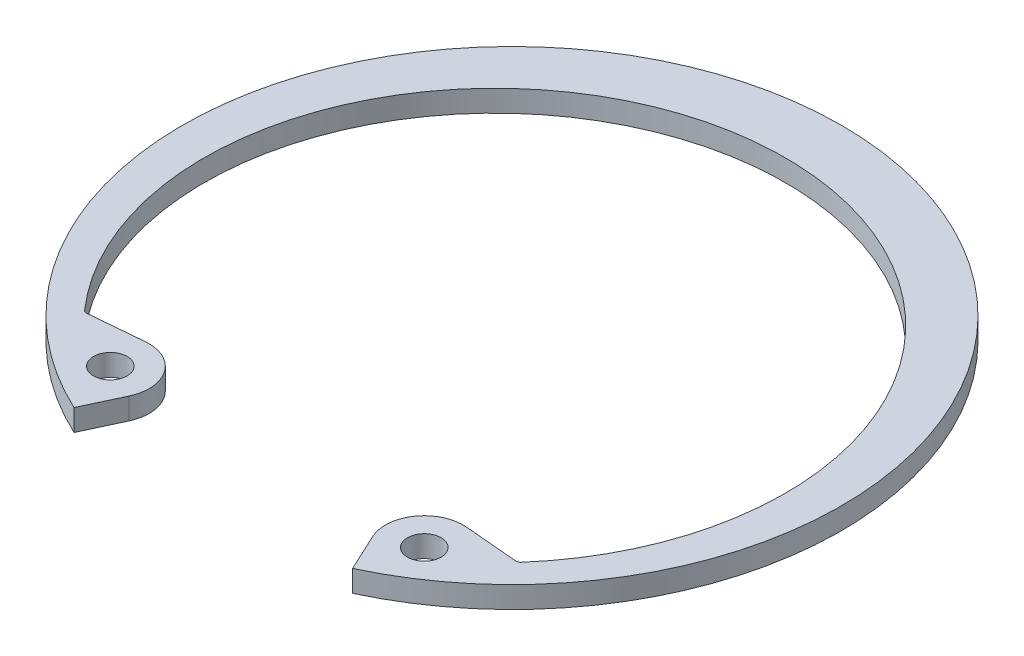
ISO-10303-21;
HEADER;
FILE_DESCRIPTION(('STEP AP214'),'2;1');
FILE_NAME('part.step','',(''),(''),'','','');
FILE_SCHEMA(('AUTOMOTIVE_DESIGN { 1 0 10303 214 1 1 1 1 }'));
ENDSEC;
DATA;
#1=APPLICATION_CONTEXT('core data for automotive mechanical design processes');
#2=APPLICATION_PROTOCOL_DEFINITION('international standard','automotive_design',2000,#1);
#3=PRODUCT_CONTEXT('',#1,'mechanical');
#4=PRODUCT('Part','Part','',(#3));
#5=PRODUCT_RELATED_PRODUCT_CATEGORY('part','',(#4));
#6=PRODUCT_DEFINITION_FORMATION('','',#4);
#7=PRODUCT_DEFINITION_CONTEXT('part definition',#1,'design');
#8=PRODUCT_DEFINITION('design','',#6,#7);
#9=PRODUCT_DEFINITION_SHAPE('','',#8);
#10=(LENGTH_UNIT() NAMED_UNIT(*) SI_UNIT(.MILLI.,.METRE.));
#11=(NAMED_UNIT(*) PLANE_ANGLE_UNIT() SI_UNIT($,.RADIAN.));
#12=(NAMED_UNIT(*) SI_UNIT($,.STERADIAN.) SOLID_ANGLE_UNIT());
#13=UNCERTAINTY_MEASURE_WITH_UNIT(LENGTH_MEASURE(1.E-05),#10,'distance_accuracy_value','');
#14=(GEOMETRIC_REPRESENTATION_CONTEXT(3) GLOBAL_UNCERTAINTY_ASSIGNED_CONTEXT((#13)) GLOBAL_UNIT_ASSIGNED_CONTEXT((#10,
#11,#12)) REPRESENTATION_CONTEXT('',''));
#15=CARTESIAN_POINT('',(0.,0.,0.));
#16=DIRECTION('',(0.,0.,1.));
#17=DIRECTION('',(1.,0.,0.));
#18=AXIS2_PLACEMENT_3D('',#15,#16,#17);
#19=CARTESIAN_POINT('',(9.23125084037704,-1.27,14.3873444930619));
#20=DIRECTION('',(0.,1.,0.));
#21=DIRECTION('',(0.,0.,1.));
#22=AXIS2_PLACEMENT_3D('',#19,#20,#21);
#23=CYLINDRICAL_SURFACE('',#22,2.286);
#24=CARTESIAN_POINT('',(9.23125084037704,0.,14.3873444930619));
#25=DIRECTION('',(0.,1.,0.));
#26=DIRECTION('',(0.,0.,-1.));
#27=AXIS2_PLACEMENT_3D('',#24,#25,#26);
#28=CIRCLE('',#27,2.286);
#29=CARTESIAN_POINT('',(9.4304888682982,0.,12.1100434132242));
#30=VERTEX_POINT('',#29);
#31=CARTESIAN_POINT('',(7.15943123921126,0.,15.3534498394011));
#32=VERTEX_POINT('',#31);
#33=EDGE_CURVE('E156',#30,#32,#28,.T.);
#34=ORIENTED_EDGE('',*,*,#33,.F.);
#35=DIRECTION('',(0.,1.,0.));
#36=VECTOR('',#35,1.);
#37=CARTESIAN_POINT('',(9.4304888682982,-1.27,12.1100434132242));
#38=LINE('',#37,#36);
#39=CARTESIAN_POINT('',(9.4304888682982,-1.27,12.1100434132242));
#40=VERTEX_POINT('',#39);
#41=EDGE_CURVE('E133',#40,#30,#38,.T.);
#42=ORIENTED_EDGE('',*,*,#41,.F.);
#43=CARTESIAN_POINT('',(9.23125084037704,-1.27,14.3873444930619));
#44=DIRECTION('',(0.,1.,0.));
#45=DIRECTION('',(0.,0.,-1.));
#46=AXIS2_PLACEMENT_3D('',#43,#44,#45);
#47=CIRCLE('',#46,2.286);
#48=CARTESIAN_POINT('',(7.15943123921126,-1.27,15.3534498394011));
#49=VERTEX_POINT('',#48);
#50=EDGE_CURVE('E126',#40,#49,#47,.T.);
#51=ORIENTED_EDGE('',*,*,#50,.T.);
#52=DIRECTION('',(0.,1.,0.));
#53=VECTOR('',#52,1.);
#54=CARTESIAN_POINT('',(7.15943123921126,-1.27,15.3534498394011));
#55=LINE('',#54,#53);
#56=EDGE_CURVE('E109',#49,#32,#55,.T.);
#57=ORIENTED_EDGE('',*,*,#56,.T.);
#58=EDGE_LOOP('',(#34,#42,#51,#57));
#59=FACE_BOUND('',#58,.T.);
#60=ADVANCED_FACE('F34',(#59),#23,.T.);
#61=CARTESIAN_POINT('',(12.7425681279921,-1.27,12.3998128011467));
#62=DIRECTION('',(0.087155742747661,0.,-0.996194698091745));
#63=DIRECTION('',(-0.996194698091745,0.,-0.087155742747661));
#64=AXIS2_PLACEMENT_3D('',#61,#62,#63);
#65=PLANE('',#64);
#66=DIRECTION('',(-0.996194698091745,0.,-0.087155742747661));
#67=VECTOR('',#66,1.);
#68=CARTESIAN_POINT('',(12.7425681279921,0.,12.3998128011467));
#69=LINE('',#68,#67);
#70=CARTESIAN_POINT('',(12.6152291663409,0.,12.3886720855771));
#71=VERTEX_POINT('',#70);
#72=EDGE_CURVE('E134',#71,#30,#69,.T.);
#73=ORIENTED_EDGE('',*,*,#72,.F.);
#74=DIRECTION('',(0.,-1.,0.));
#75=VECTOR('',#74,1.);
#76=CARTESIAN_POINT('',(12.6152291663409,-1.27,12.3886720855771));
#77=LINE('',#76,#75);
#78=CARTESIAN_POINT('',(12.6152291663409,-1.27,12.3886720855771));
#79=VERTEX_POINT('',#78);
#80=EDGE_CURVE('E49',#71,#79,#77,.T.);
#81=ORIENTED_EDGE('',*,*,#80,.T.);
#82=DIRECTION('',(-0.996194698091745,0.,-0.087155742747661));
#83=VECTOR('',#82,1.);
#84=CARTESIAN_POINT('',(12.7425681279921,-1.27,12.3998128011467));
#85=LINE('',#84,#83);
#86=EDGE_CURVE('E120',#79,#40,#85,.T.);
#87=ORIENTED_EDGE('',*,*,#86,.T.);
#88=ORIENTED_EDGE('',*,*,#41,.T.);
#89=EDGE_LOOP('',(#73,#81,#87,#88));
#90=FACE_BOUND('',#89,.T.);
#91=ADVANCED_FACE('F211',(#90),#65,.T.);
#92=CARTESIAN_POINT('',(0.,-1.27,1.01165564399354));
#93=DIRECTION('',(0.,1.,0.));
#94=DIRECTION('',(0.,0.,1.));
#95=AXIS2_PLACEMENT_3D('',#92,#93,#94);
#96=CYLINDRICAL_SURFACE('',#95,17.0898556439935);
#97=CARTESIAN_POINT('',(0.,0.,1.01165564399354));
#98=DIRECTION('',(0.,-1.,0.));
#99=DIRECTION('',(0.,0.,1.));
#100=AXIS2_PLACEMENT_3D('',#97,#98,#99);
#101=CIRCLE('',#100,17.0898556439935);
#102=CARTESIAN_POINT('',(-12.8280247596141,0.,12.3034644760304));
#103=VERTEX_POINT('',#102);
#104=CARTESIAN_POINT('',(12.8280247596141,0.,12.3034644760304));
#105=VERTEX_POINT('',#104);
#106=EDGE_CURVE('E136',#103,#105,#101,.T.);
#107=ORIENTED_EDGE('',*,*,#106,.F.);
#108=DIRECTION('',(0.,1.,0.));
#109=VECTOR('',#108,1.);
#110=CARTESIAN_POINT('',(-12.8280247596141,-1.27,12.3034644760304));
#111=LINE('',#110,#109);
#112=CARTESIAN_POINT('',(-12.8280247596141,-1.27,12.3034644760304));
#113=VERTEX_POINT('',#112);
#114=EDGE_CURVE('E187',#103,#113,#111,.F.);
#115=ORIENTED_EDGE('',*,*,#114,.T.);
#116=CARTESIAN_POINT('',(0.,-1.27,1.01165564399354));
#117=DIRECTION('',(0.,-1.,0.));
#118=DIRECTION('',(0.,0.,1.));
#119=AXIS2_PLACEMENT_3D('',#116,#117,#118);
#120=CIRCLE('',#119,17.0898556439935);
#121=CARTESIAN_POINT('',(12.8280247596141,-1.27,12.3034644760304));
#122=VERTEX_POINT('',#121);
#123=EDGE_CURVE('E152',#113,#122,#120,.T.);
#124=ORIENTED_EDGE('',*,*,#123,.T.);
#125=DIRECTION('',(0.,1.,0.));
#126=VECTOR('',#125,1.);
#127=CARTESIAN_POINT('',(12.8280247596141,-1.27,12.3034644760304));
#128=LINE('',#127,#126);
#129=EDGE_CURVE('E184',#122,#105,#128,.T.);
#130=ORIENTED_EDGE('',*,*,#129,.T.);
#131=EDGE_LOOP('',(#107,#115,#124,#130));
#132=FACE_BOUND('',#131,.T.);
#133=ADVANCED_FACE('F207',(#132),#96,.F.);
#134=CARTESIAN_POINT('',(-12.742568127992,-1.27,12.3998128011467));
#135=DIRECTION('',(-0.0871557427476563,0.,-0.996194698091746));
#136=DIRECTION('',(-0.996194698091746,0.,0.0871557427476563));
#137=AXIS2_PLACEMENT_3D('',#134,#135,#136);
#138=PLANE('',#137);
#139=DIRECTION('',(-0.996194698091746,0.,0.0871557427476563));
#140=VECTOR('',#139,1.);
#141=CARTESIAN_POINT('',(-12.742568127992,-1.27,12.3998128011467));
#142=LINE('',#141,#140);
#143=CARTESIAN_POINT('',(-9.43048886829818,-1.27,12.1100434132242));
#144=VERTEX_POINT('',#143);
#145=CARTESIAN_POINT('',(-12.6152291663409,-1.27,12.3886720855771));
#146=VERTEX_POINT('',#145);
#147=EDGE_CURVE('E149',#144,#146,#142,.T.);
#148=ORIENTED_EDGE('',*,*,#147,.T.);
#149=DIRECTION('',(0.,-1.,0.));
#150=VECTOR('',#149,1.);
#151=CARTESIAN_POINT('',(-12.6152291663409,0.,12.3886720855771));
#152=LINE('',#151,#150);
#153=CARTESIAN_POINT('',(-12.6152291663409,0.,12.3886720855771));
#154=VERTEX_POINT('',#153);
#155=EDGE_CURVE('E174',#146,#154,#152,.F.);
#156=ORIENTED_EDGE('',*,*,#155,.T.);
#157=DIRECTION('',(-0.996194698091746,0.,0.0871557427476563));
#158=VECTOR('',#157,1.);
#159=CARTESIAN_POINT('',(-12.742568127992,0.,12.3998128011467));
#160=LINE('',#159,#158);
#161=CARTESIAN_POINT('',(-9.43048886829818,0.,12.1100434132242));
#162=VERTEX_POINT('',#161);
#163=EDGE_CURVE('E169',#162,#154,#160,.T.);
#164=ORIENTED_EDGE('',*,*,#163,.F.);
#165=DIRECTION('',(0.,1.,0.));
#166=VECTOR('',#165,1.);
#167=CARTESIAN_POINT('',(-9.43048886829818,-1.27,12.1100434132242));
#168=LINE('',#167,#166);
#169=EDGE_CURVE('E175',#144,#162,#168,.T.);
#170=ORIENTED_EDGE('',*,*,#169,.F.);
#171=EDGE_LOOP('',(#148,#156,#164,#170));
#172=FACE_BOUND('',#171,.T.);
#173=ADVANCED_FACE('F201',(#172),#138,.T.);
#174=CARTESIAN_POINT('',(-9.23125084037704,-1.27,14.3873444930619));
#175=DIRECTION('',(0.,1.,0.));
#176=DIRECTION('',(0.,0.,1.));
#177=AXIS2_PLACEMENT_3D('',#174,#175,#176);
#178=CYLINDRICAL_SURFACE('',#177,2.286);
#179=CARTESIAN_POINT('',(-9.23125084037704,0.,14.3873444930619));
#180=DIRECTION('',(0.,1.,0.));
#181=DIRECTION('',(0.,0.,1.));
#182=AXIS2_PLACEMENT_3D('',#179,#180,#181);
#183=CIRCLE('',#182,2.286);
#184=CARTESIAN_POINT('',(-7.15943123921126,0.,15.3534498394011));
#185=VERTEX_POINT('',#184);
#186=EDGE_CURVE('E166',#185,#162,#183,.T.);
#187=ORIENTED_EDGE('',*,*,#186,.F.);
#188=DIRECTION('',(0.,1.,0.));
#189=VECTOR('',#188,1.);
#190=CARTESIAN_POINT('',(-7.15943123921126,-1.27,15.3534498394011));
#191=LINE('',#190,#189);
#192=CARTESIAN_POINT('',(-7.15943123921126,-1.27,15.3534498394011));
#193=VERTEX_POINT('',#192);
#194=EDGE_CURVE('E177',#193,#185,#191,.T.);
#195=ORIENTED_EDGE('',*,*,#194,.F.);
#196=CARTESIAN_POINT('',(-9.23125084037704,-1.27,14.3873444930619));
#197=DIRECTION('',(0.,1.,0.));
#198=DIRECTION('',(0.,0.,1.));
#199=AXIS2_PLACEMENT_3D('',#196,#197,#198);
#200=CIRCLE('',#199,2.286);
#201=EDGE_CURVE('E146',#193,#144,#200,.T.);
#202=ORIENTED_EDGE('',*,*,#201,.T.);
#203=ORIENTED_EDGE('',*,*,#169,.T.);
#204=EDGE_LOOP('',(#187,#195,#202,#203));
#205=FACE_BOUND('',#204,.T.);
#206=ADVANCED_FACE('F220',(#205),#178,.T.);
#207=CARTESIAN_POINT('',(-8.19042643618699,-1.27,17.5644261743277));
#208=DIRECTION('',(0.906307787036653,0.,0.422618261740693));
#209=DIRECTION('',(0.422618261740693,0.,-0.906307787036653));
#210=AXIS2_PLACEMENT_3D('',#207,#208,#209);
#211=PLANE('',#210);
#212=DIRECTION('',(0.422618261740693,0.,-0.906307787036653));
#213=VECTOR('',#212,1.);
#214=CARTESIAN_POINT('',(-8.19042643618699,0.,17.5644261743277));
#215=LINE('',#214,#213);
#216=CARTESIAN_POINT('',(-8.19042643618701,0.,17.5644261743277));
#217=VERTEX_POINT('',#216);
#218=EDGE_CURVE('E163',#217,#185,#215,.T.);
#219=ORIENTED_EDGE('',*,*,#218,.F.);
#220=DIRECTION('',(0.,1.,0.));
#221=VECTOR('',#220,1.);
#222=CARTESIAN_POINT('',(-8.19042643618701,-1.27,17.5644261743277));
#223=LINE('',#222,#221);
#224=CARTESIAN_POINT('',(-8.19042643618701,-1.27,17.5644261743277));
#225=VERTEX_POINT('',#224);
#226=EDGE_CURVE('E179',#225,#217,#223,.T.);
#227=ORIENTED_EDGE('',*,*,#226,.F.);
#228=DIRECTION('',(0.422618261740693,0.,-0.906307787036653));
#229=VECTOR('',#228,1.);
#230=CARTESIAN_POINT('',(-8.19042643618699,-1.27,17.5644261743277));
#231=LINE('',#230,#229);
#232=EDGE_CURVE('E143',#225,#193,#231,.T.);
#233=ORIENTED_EDGE('',*,*,#232,.T.);
#234=ORIENTED_EDGE('',*,*,#194,.T.);
#235=EDGE_LOOP('',(#219,#227,#233,#234));
#236=FACE_BOUND('',#235,.T.);
#237=ADVANCED_FACE('F217',(#236),#211,.T.);
#238=CARTESIAN_POINT('',(0.,-1.27,0.));
#239=DIRECTION('',(0.,1.,0.));
#240=DIRECTION('',(0.,0.,1.));
#241=AXIS2_PLACEMENT_3D('',#238,#239,#240);
#242=CYLINDRICAL_SURFACE('',#241,19.3802);
#243=CARTESIAN_POINT('',(0.,0.,0.));
#244=DIRECTION('',(0.,1.,0.));
#245=DIRECTION('',(0.,0.,1.));
#246=AXIS2_PLACEMENT_3D('',#243,#244,#245);
#247=CIRCLE('',#246,19.3802);
#248=CARTESIAN_POINT('',(8.19042643618699,0.,17.5644261743277));
#249=VERTEX_POINT('',#248);
#250=EDGE_CURVE('E160',#249,#217,#247,.T.);
#251=ORIENTED_EDGE('',*,*,#250,.F.);
#252=DIRECTION('',(0.,1.,0.));
#253=VECTOR('',#252,1.);
#254=CARTESIAN_POINT('',(8.19042643618699,-1.27,17.5644261743277));
#255=LINE('',#254,#253);
#256=CARTESIAN_POINT('',(8.19042643618699,-1.27,17.5644261743277));
#257=VERTEX_POINT('',#256);
#258=EDGE_CURVE('E119',#257,#249,#255,.T.);
#259=ORIENTED_EDGE('',*,*,#258,.F.);
#260=CARTESIAN_POINT('',(0.,-1.27,0.));
#261=DIRECTION('',(0.,1.,0.));
#262=DIRECTION('',(0.,0.,1.));
#263=AXIS2_PLACEMENT_3D('',#260,#261,#262);
#264=CIRCLE('',#263,19.3802);
#265=EDGE_CURVE('E129',#257,#225,#264,.T.);
#266=ORIENTED_EDGE('',*,*,#265,.T.);
#267=ORIENTED_EDGE('',*,*,#226,.T.);
#268=EDGE_LOOP('',(#251,#259,#266,#267));
#269=FACE_BOUND('',#268,.T.);
#270=ADVANCED_FACE('F215',(#269),#242,.T.);
#271=CARTESIAN_POINT('',(8.19042643618699,-1.27,17.5644261743277));
#272=DIRECTION('',(-0.906307787036653,0.,0.422618261740693));
#273=DIRECTION('',(0.422618261740693,0.,0.906307787036653));
#274=AXIS2_PLACEMENT_3D('',#271,#272,#273);
#275=PLANE('',#274);
#276=DIRECTION('',(0.422618261740693,0.,0.906307787036653));
#277=VECTOR('',#276,1.);
#278=CARTESIAN_POINT('',(8.19042643618699,0.,17.5644261743277));
#279=LINE('',#278,#277);
#280=EDGE_CURVE('E114',#32,#249,#279,.T.);
#281=ORIENTED_EDGE('',*,*,#280,.F.);
#282=ORIENTED_EDGE('',*,*,#56,.F.);
#283=DIRECTION('',(0.422618261740693,0.,0.906307787036653));
#284=VECTOR('',#283,1.);
#285=CARTESIAN_POINT('',(8.19042643618699,-1.27,17.5644261743277));
#286=LINE('',#285,#284);
#287=EDGE_CURVE('E112',#49,#257,#286,.T.);
#288=ORIENTED_EDGE('',*,*,#287,.T.);
#289=ORIENTED_EDGE('',*,*,#258,.T.);
#290=EDGE_LOOP('',(#281,#282,#288,#289));
#291=FACE_BOUND('',#290,.T.);
#292=ADVANCED_FACE('F111',(#291),#275,.T.);
#293=CARTESIAN_POINT('',(9.23125084037704,-1.27,14.3873444930619));
#294=DIRECTION('',(0.,-1.,0.));
#295=DIRECTION('',(0.,0.,-1.));
#296=AXIS2_PLACEMENT_3D('',#293,#294,#295);
#297=PLANE('',#296);
#298=CARTESIAN_POINT('',(-9.23125084037704,-1.27,14.3873444930619));
#299=DIRECTION('',(0.,1.,0.));
#300=DIRECTION('',(0.,0.,1.));
#301=AXIS2_PLACEMENT_3D('',#298,#299,#300);
#302=CIRCLE('',#301,0.990599999999999);
#303=CARTESIAN_POINT('',(-9.23125084037704,-1.27,15.3779444930619));
#304=VERTEX_POINT('',#303);
#305=EDGE_CURVE('E359',#304,#304,#302,.T.);
#306=ORIENTED_EDGE('',*,*,#305,.T.);
#307=EDGE_LOOP('',(#306));
#308=FACE_BOUND('',#307,.T.);
#309=CARTESIAN_POINT('',(9.23125084037704,-1.27,14.3873444930619));
#310=DIRECTION('',(0.,1.,0.));
#311=DIRECTION('',(0.,0.,1.));
#312=AXIS2_PLACEMENT_3D('',#309,#310,#311);
#313=CIRCLE('',#312,0.990599999999999);
#314=CARTESIAN_POINT('',(9.23125084037704,-1.27,15.3779444930619));
#315=VERTEX_POINT('',#314);
#316=EDGE_CURVE('E158',#315,#315,#313,.T.);
#317=ORIENTED_EDGE('',*,*,#316,.T.);
#318=EDGE_LOOP('',(#317));
#319=FACE_BOUND('',#318,.T.);
#320=ORIENTED_EDGE('',*,*,#50,.F.);
#321=ORIENTED_EDGE('',*,*,#86,.F.);
#322=CARTESIAN_POINT('',(12.6373667249989,-1.27,12.1356386322618));
#323=DIRECTION('',(0.,-1.,0.));
#324=DIRECTION('',(0.,0.,-1.));
#325=AXIS2_PLACEMENT_3D('',#322,#323,#324);
#326=CIRCLE('',#325,0.254);
#327=EDGE_CURVE('E11',#79,#122,#326,.F.);
#328=ORIENTED_EDGE('',*,*,#327,.T.);
#329=ORIENTED_EDGE('',*,*,#123,.F.);
#330=CARTESIAN_POINT('',(-12.6373667249988,-1.27,12.1356386322618));
#331=DIRECTION('',(0.,-1.,0.));
#332=DIRECTION('',(0.,0.,-1.));
#333=AXIS2_PLACEMENT_3D('',#330,#331,#332);
#334=CIRCLE('',#333,0.254);
#335=EDGE_CURVE('E192',#113,#146,#334,.F.);
#336=ORIENTED_EDGE('',*,*,#335,.T.);
#337=ORIENTED_EDGE('',*,*,#147,.F.);
#338=ORIENTED_EDGE('',*,*,#201,.F.);
#339=ORIENTED_EDGE('',*,*,#232,.F.);
#340=ORIENTED_EDGE('',*,*,#265,.F.);
#341=ORIENTED_EDGE('',*,*,#287,.F.);
#342=EDGE_LOOP('',(#320,#321,#328,#329,#336,#337,#338,#339,#340,#341));
#343=FACE_BOUND('',#342,.T.);
#344=ADVANCED_FACE('F125',(#308,#319,#343),#297,.T.);
#345=CARTESIAN_POINT('',(9.23125084037704,0.,14.3873444930619));
#346=DIRECTION('',(0.,-1.,0.));
#347=DIRECTION('',(0.,0.,-1.));
#348=AXIS2_PLACEMENT_3D('',#345,#346,#347);
#349=PLANE('',#348);
#350=CARTESIAN_POINT('',(-9.23125084037704,0.,14.3873444930619));
#351=DIRECTION('',(0.,1.,0.));
#352=DIRECTION('',(0.,0.,1.));
#353=AXIS2_PLACEMENT_3D('',#350,#351,#352);
#354=CIRCLE('',#353,0.990599999999999);
#355=CARTESIAN_POINT('',(-9.23125084037704,0.,15.3779444930619));
#356=VERTEX_POINT('',#355);
#357=EDGE_CURVE('E355',#356,#356,#354,.T.);
#358=ORIENTED_EDGE('',*,*,#357,.F.);
#359=EDGE_LOOP('',(#358));
#360=FACE_BOUND('',#359,.T.);
#361=CARTESIAN_POINT('',(9.23125084037704,0.,14.3873444930619));
#362=DIRECTION('',(0.,1.,0.));
#363=DIRECTION('',(0.,0.,1.));
#364=AXIS2_PLACEMENT_3D('',#361,#362,#363);
#365=CIRCLE('',#364,0.990599999999999);
#366=CARTESIAN_POINT('',(9.23125084037704,0.,15.3779444930619));
#367=VERTEX_POINT('',#366);
#368=EDGE_CURVE('E139',#367,#367,#365,.T.);
#369=ORIENTED_EDGE('',*,*,#368,.F.);
#370=EDGE_LOOP('',(#369));
#371=FACE_BOUND('',#370,.T.);
#372=ORIENTED_EDGE('',*,*,#33,.T.);
#373=ORIENTED_EDGE('',*,*,#280,.T.);
#374=ORIENTED_EDGE('',*,*,#250,.T.);
#375=ORIENTED_EDGE('',*,*,#218,.T.);
#376=ORIENTED_EDGE('',*,*,#186,.T.);
#377=ORIENTED_EDGE('',*,*,#163,.T.);
#378=CARTESIAN_POINT('',(-12.6373667249988,0.,12.1356386322618));
#379=DIRECTION('',(0.,-1.,0.));
#380=DIRECTION('',(0.,0.,-1.));
#381=AXIS2_PLACEMENT_3D('',#378,#379,#380);
#382=CIRCLE('',#381,0.254);
#383=EDGE_CURVE('E190',#154,#103,#382,.T.);
#384=ORIENTED_EDGE('',*,*,#383,.T.);
#385=ORIENTED_EDGE('',*,*,#106,.T.);
#386=CARTESIAN_POINT('',(12.6373667249989,0.,12.1356386322618));
#387=DIRECTION('',(0.,-1.,0.));
#388=DIRECTION('',(0.,0.,-1.));
#389=AXIS2_PLACEMENT_3D('',#386,#387,#388);
#390=CIRCLE('',#389,0.254);
#391=EDGE_CURVE('E42',#105,#71,#390,.T.);
#392=ORIENTED_EDGE('',*,*,#391,.T.);
#393=ORIENTED_EDGE('',*,*,#72,.T.);
#394=EDGE_LOOP('',(#372,#373,#374,#375,#376,#377,#384,#385,#392,#393));
#395=FACE_BOUND('',#394,.T.);
#396=ADVANCED_FACE('F205',(#360,#371,#395),#349,.F.);
#397=CARTESIAN_POINT('',(9.23125084037704,-1.27,14.3873444930619));
#398=DIRECTION('',(0.,1.,0.));
#399=DIRECTION('',(0.,0.,1.));
#400=AXIS2_PLACEMENT_3D('',#397,#398,#399);
#401=CYLINDRICAL_SURFACE('',#400,0.990599999999999);
#402=ORIENTED_EDGE('',*,*,#316,.F.);
#403=EDGE_LOOP('',(#402));
#404=FACE_BOUND('',#403,.T.);
#405=ORIENTED_EDGE('',*,*,#368,.T.);
#406=EDGE_LOOP('',(#405));
#407=FACE_BOUND('',#406,.T.);
#408=ADVANCED_FACE('F243',(#404,#407),#401,.F.);
#409=CARTESIAN_POINT('',(-9.23125084037704,-1.27,14.3873444930619));
#410=DIRECTION('',(0.,1.,0.));
#411=DIRECTION('',(0.,0.,1.));
#412=AXIS2_PLACEMENT_3D('',#409,#410,#411);
#413=CYLINDRICAL_SURFACE('',#412,0.990599999999999);
#414=ORIENTED_EDGE('',*,*,#305,.F.);
#415=EDGE_LOOP('',(#414));
#416=FACE_BOUND('',#415,.T.);
#417=ORIENTED_EDGE('',*,*,#357,.T.);
#418=EDGE_LOOP('',(#417));
#419=FACE_BOUND('',#418,.T.);
#420=ADVANCED_FACE('F238',(#416,#419),#413,.F.);
#421=CARTESIAN_POINT('',(-12.6373667249988,-1.27,12.1356386322618));
#422=DIRECTION('',(0.,1.,0.));
#423=DIRECTION('',(0.,0.,1.));
#424=AXIS2_PLACEMENT_3D('',#421,#422,#423);
#425=CYLINDRICAL_SURFACE('',#424,0.254);
#426=ORIENTED_EDGE('',*,*,#335,.F.);
#427=ORIENTED_EDGE('',*,*,#114,.F.);
#428=ORIENTED_EDGE('',*,*,#383,.F.);
#429=ORIENTED_EDGE('',*,*,#155,.F.);
#430=EDGE_LOOP('',(#426,#427,#428,#429));
#431=FACE_BOUND('',#430,.T.);
#432=ADVANCED_FACE('F203',(#431),#425,.F.);
#433=CARTESIAN_POINT('',(12.6373667249989,-1.27,12.1356386322618));
#434=DIRECTION('',(0.,1.,0.));
#435=DIRECTION('',(0.,0.,1.));
#436=AXIS2_PLACEMENT_3D('',#433,#434,#435);
#437=CYLINDRICAL_SURFACE('',#436,0.254);
#438=ORIENTED_EDGE('',*,*,#327,.F.);
#439=ORIENTED_EDGE('',*,*,#80,.F.);
#440=ORIENTED_EDGE('',*,*,#391,.F.);
#441=ORIENTED_EDGE('',*,*,#129,.F.);
#442=EDGE_LOOP('',(#438,#439,#440,#441));
#443=FACE_BOUND('',#442,.T.);
#444=ADVANCED_FACE('F36',(#443),#437,.F.);
#445=CLOSED_SHELL('',(#60,#91,#133,#173,#206,#237,#270,#292,#344,#396,#408,#420,#432,#444));
#446=MANIFOLD_SOLID_BREP('B2',#445);
#447=ADVANCED_BREP_SHAPE_REPRESENTATION('',(#18,#446),#14);
#448=SHAPE_DEFINITION_REPRESENTATION(#9,#447);
ENDSEC;
END-ISO-10303-21;
